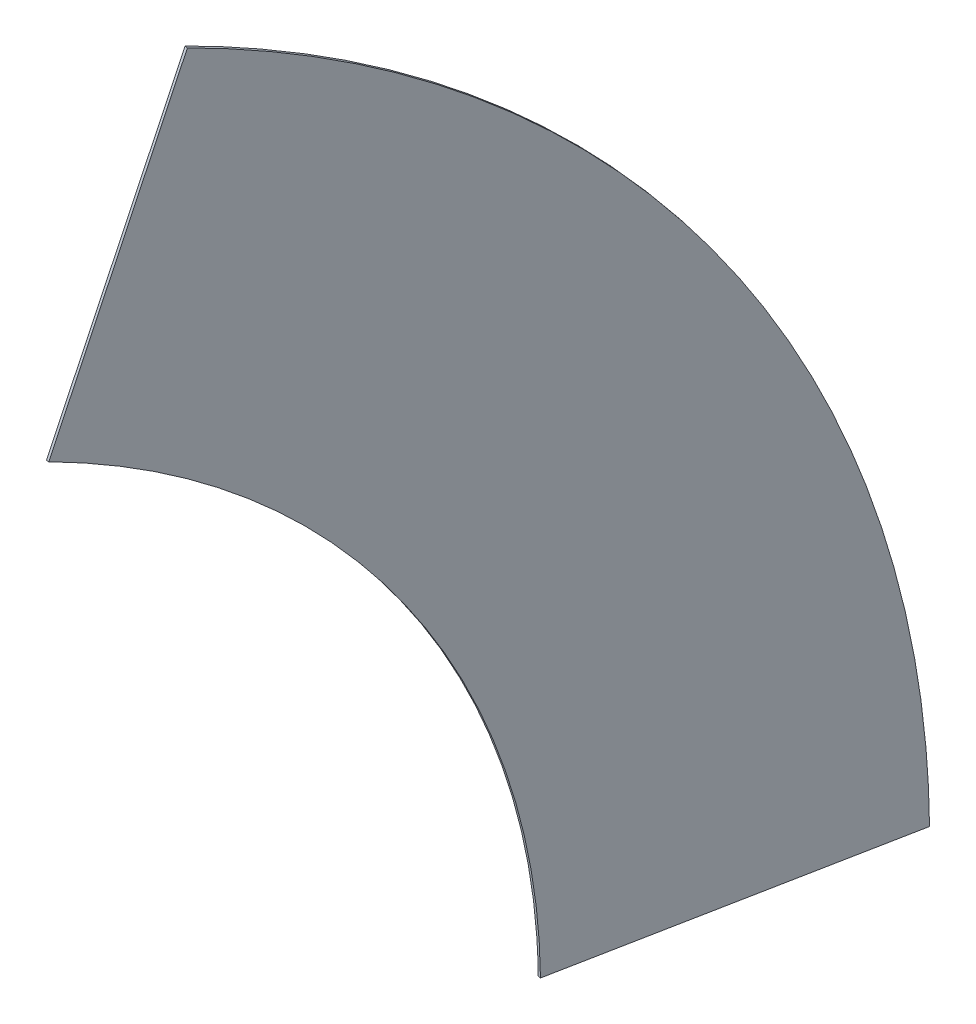
ISO-10303-21;
HEADER;
FILE_DESCRIPTION(('STEP AP214'),'2;1');
FILE_NAME('part.step','',(''),(''),'','','');
FILE_SCHEMA(('AUTOMOTIVE_DESIGN { 1 0 10303 214 1 1 1 1 }'));
ENDSEC;
DATA;
#1=APPLICATION_CONTEXT('core data for automotive mechanical design processes');
#2=APPLICATION_PROTOCOL_DEFINITION('international standard','automotive_design',2000,#1);
#3=PRODUCT_CONTEXT('',#1,'mechanical');
#4=PRODUCT('Part','Part','',(#3));
#5=PRODUCT_RELATED_PRODUCT_CATEGORY('part','',(#4));
#6=PRODUCT_DEFINITION_FORMATION('','',#4);
#7=PRODUCT_DEFINITION_CONTEXT('part definition',#1,'design');
#8=PRODUCT_DEFINITION('design','',#6,#7);
#9=PRODUCT_DEFINITION_SHAPE('','',#8);
#10=(LENGTH_UNIT() NAMED_UNIT(*) SI_UNIT(.MILLI.,.METRE.));
#11=(NAMED_UNIT(*) PLANE_ANGLE_UNIT() SI_UNIT($,.RADIAN.));
#12=(NAMED_UNIT(*) SI_UNIT($,.STERADIAN.) SOLID_ANGLE_UNIT());
#13=UNCERTAINTY_MEASURE_WITH_UNIT(LENGTH_MEASURE(1.E-05),#10,'distance_accuracy_value','');
#14=(GEOMETRIC_REPRESENTATION_CONTEXT(3) GLOBAL_UNCERTAINTY_ASSIGNED_CONTEXT((#13)) GLOBAL_UNIT_ASSIGNED_CONTEXT((#10,
#11,#12)) REPRESENTATION_CONTEXT('',''));
#15=CARTESIAN_POINT('',(0.,0.,0.));
#16=DIRECTION('',(0.,0.,1.));
#17=DIRECTION('',(1.,0.,0.));
#18=AXIS2_PLACEMENT_3D('',#15,#16,#17);
#19=CARTESIAN_POINT('',(528.314395580235,4.71909444700552,-0.984792222446074));
#20=DIRECTION('',(0.0103269269280288,-0.999944706836072,0.00198440186080273));
#21=DIRECTION('',(-0.190880415844772,-2.32941397990886E-05,0.981613297742197));
#22=AXIS2_PLACEMENT_3D('',#19,#20,#21);
#23=PLANE('',#22);
#24=DIRECTION('',(-0.981558975012276,-0.0105158322497583,-0.190870102019527));
#25=VECTOR('',#24,1.);
#26=CARTESIAN_POINT('',(528.314395580235,4.71909444700552,-0.984792222446072));
#27=LINE('',#26,#25);
#28=CARTESIAN_POINT('',(533.378626416939,4.77334956901912,-2.17898390997284E-05));
#29=VERTEX_POINT('',#28);
#30=CARTESIAN_POINT('',(525.587502052779,4.68988015053666,-1.51505322461909));
#31=VERTEX_POINT('',#30);
#32=EDGE_CURVE('E13',#29,#31,#27,.T.);
#33=ORIENTED_EDGE('',*,*,#32,.F.);
#34=DIRECTION('',(-0.190880415844772,-2.32941397990886E-05,0.981613297742197));
#35=VECTOR('',#34,1.);
#36=CARTESIAN_POINT('',(533.378626416939,4.77334956901912,-2.17898390997284E-05));
#37=LINE('',#36,#35);
#38=CARTESIAN_POINT('',(355.568218827284,4.75165043098133,914.400021789835));
#39=VERTEX_POINT('',#38);
#40=EDGE_CURVE('E375',#29,#39,#37,.T.);
#41=ORIENTED_EDGE('',*,*,#40,.T.);
#42=DIRECTION('',(-0.981558975012276,-0.0105158322497583,-0.190870102019527));
#43=VECTOR('',#42,1.);
#44=CARTESIAN_POINT('',(350.50398799058,4.69739530896773,913.415251357228));
#45=LINE('',#44,#43);
#46=CARTESIAN_POINT('',(347.777094463124,4.66818101249887,912.884990355055));
#47=VERTEX_POINT('',#46);
#48=EDGE_CURVE('E345',#39,#47,#45,.T.);
#49=ORIENTED_EDGE('',*,*,#48,.T.);
#50=DIRECTION('',(-0.190880415844772,-2.32941397990886E-05,0.981613297742197));
#51=VECTOR('',#50,1.);
#52=CARTESIAN_POINT('',(525.587502052779,4.68988015053667,-1.51505322461909));
#53=LINE('',#52,#51);
#54=EDGE_CURVE('E377',#31,#47,#53,.T.);
#55=ORIENTED_EDGE('',*,*,#54,.F.);
#56=EDGE_LOOP('',(#33,#41,#49,#55));
#57=FACE_BOUND('',#56,.T.);
#58=ADVANCED_FACE('F332',(#57),#23,.T.);
#59=CARTESIAN_POINT('',(347.777094463124,4.66818101249887,912.884990355055));
#60=CARTESIAN_POINT('',(346.787229060155,96.2196070562848,912.931471347845));
#61=CARTESIAN_POINT('',(344.504077378978,187.228931698317,919.658607862617));
#62=CARTESIAN_POINT('',(337.349981950212,368.208197090521,946.477994065531));
#63=CARTESIAN_POINT('',(332.518876649427,457.167595136207,966.42104758754));
#64=CARTESIAN_POINT('',(320.349219834697,632.016310584688,1019.37096484352));
#65=CARTESIAN_POINT('',(313.077945646682,716.937581121348,1052.08518533984));
#66=CARTESIAN_POINT('',(296.163053323035,881.768611472898,1129.98962794023));
#67=CARTESIAN_POINT('',(286.613221317811,960.76419398381,1174.74791606414));
#68=CARTESIAN_POINT('',(265.32982597315,1111.9081056179,1275.87168293359));
#69=CARTESIAN_POINT('',(253.713835041288,1183.22082189538,1331.6785771432));
#70=CARTESIAN_POINT('',(228.534671820406,1317.32029174413,1453.77557330167));
#71=CARTESIAN_POINT('',(215.111005758201,1379.36354602387,1519.38922003933));
#72=CARTESIAN_POINT('',(186.596412531771,1493.43346172051,1659.74234249575));
#73=CARTESIAN_POINT('',(171.662672156567,1544.83039264293,1733.70817183558));
#74=CARTESIAN_POINT('',(140.448320568531,1636.33056362603,1889.18839732688));
#75=CARTESIAN_POINT('',(124.33846113981,1675.93285916222,1969.85229308101));
#76=CARTESIAN_POINT('',(107.725918076385,1709.38736474306,2053.43997184362));
#77=CARTESIAN_POINT('',(355.568218827284,4.75165043098133,914.400021789835));
#78=CARTESIAN_POINT('',(354.578353424315,96.3030764747675,914.446502782625));
#79=CARTESIAN_POINT('',(352.295201743138,187.3124011168,921.173639297397));
#80=CARTESIAN_POINT('',(345.141106314372,368.291666509003,947.993025500311));
#81=CARTESIAN_POINT('',(340.310001013587,457.251064554689,967.93607902232));
#82=CARTESIAN_POINT('',(328.140344198858,632.099780003171,1020.8859962783));
#83=CARTESIAN_POINT('',(320.869070010842,717.02105053983,1053.60021677462));
#84=CARTESIAN_POINT('',(303.954177687195,881.85208089138,1131.50465937501));
#85=CARTESIAN_POINT('',(294.404345681971,960.847663402292,1176.26294749892));
#86=CARTESIAN_POINT('',(273.12095033731,1111.99157503639,1277.38671436837));
#87=CARTESIAN_POINT('',(261.504959405447,1183.30429131386,1333.19360857798));
#88=CARTESIAN_POINT('',(236.325796184566,1317.40376116262,1455.29060473645));
#89=CARTESIAN_POINT('',(222.902130122361,1379.44701544235,1520.90425147411));
#90=CARTESIAN_POINT('',(194.387536895931,1493.51693113899,1661.25737393053));
#91=CARTESIAN_POINT('',(179.453796520727,1544.91386206141,1735.22320327036));
#92=CARTESIAN_POINT('',(148.239444932691,1636.41403304451,1890.70342876166));
#93=CARTESIAN_POINT('',(132.12958550397,1676.0163285807,1971.36732451579));
#94=CARTESIAN_POINT('',(115.517042440545,1709.47083416154,2054.9550032784));
#95=B_SPLINE_SURFACE_WITH_KNOTS('',1,3,((#59,#60,#61,#62,#63,#64,#65,#66,#67,#68,#69,#70,#71,
#72,#73,#74,#75,#76),(#77,#78,#79,#80,#81,#82,#83,#84,#85,#86,#87,#88,#89,#90,#91,#92,#93,#94)),
.UNSPECIFIED.,.F.,.F.,.F.,(2,2),(4,2,2,2,2,2,2,2,4),(0.,1.),(0.,0.125,0.25,0.375,0.5,0.625,0.75,
0.875,1.),.UNSPECIFIED.);
#96=CARTESIAN_POINT('',(355.568218827284,4.75165043098133,914.400021789835));
#97=CARTESIAN_POINT('',(354.578353424315,96.3030764747675,914.446502782625));
#98=CARTESIAN_POINT('',(352.295201743138,187.3124011168,921.173639297397));
#99=CARTESIAN_POINT('',(345.141106314372,368.291666509003,947.993025500311));
#100=CARTESIAN_POINT('',(340.310001013587,457.251064554689,967.93607902232));
#101=CARTESIAN_POINT('',(328.140344198858,632.099780003171,1020.8859962783));
#102=CARTESIAN_POINT('',(320.869070010842,717.02105053983,1053.60021677462));
#103=CARTESIAN_POINT('',(303.954177687195,881.85208089138,1131.50465937501));
#104=CARTESIAN_POINT('',(294.404345681971,960.847663402292,1176.26294749892));
#105=CARTESIAN_POINT('',(273.12095033731,1111.99157503639,1277.38671436837));
#106=CARTESIAN_POINT('',(261.504959405447,1183.30429131386,1333.19360857798));
#107=CARTESIAN_POINT('',(236.325796184566,1317.40376116262,1455.29060473645));
#108=CARTESIAN_POINT('',(222.902130122361,1379.44701544235,1520.90425147411));
#109=CARTESIAN_POINT('',(194.387536895931,1493.51693113899,1661.25737393053));
#110=CARTESIAN_POINT('',(179.453796520727,1544.91386206141,1735.22320327036));
#111=CARTESIAN_POINT('',(148.239444932691,1636.41403304451,1890.70342876166));
#112=CARTESIAN_POINT('',(132.12958550397,1676.0163285807,1971.36732451579));
#113=CARTESIAN_POINT('',(115.517042440545,1709.47083416154,2054.9550032784));
#114=B_SPLINE_CURVE_WITH_KNOTS('',3,(#96,#97,#98,#99,#100,#101,#102,#103,#104,#105,#106,#107,
#108,#109,#110,#111,#112,#113),.UNSPECIFIED.,.F.,.F.,(4,2,2,2,2,2,2,2,4),(0.,0.125,0.25,0.375,
0.5,0.625,0.75,0.875,1.),.UNSPECIFIED.);
#115=CARTESIAN_POINT('',(115.517042440545,1709.47083416154,2054.9550032784));
#116=VERTEX_POINT('',#115);
#117=EDGE_CURVE('E390',#39,#116,#114,.T.);
#118=DIRECTION('',(-0.981558975012277,-0.0105158322497583,-0.190870102019527));
#119=VECTOR('',#118,1.);
#120=CARTESIAN_POINT('',(110.452811603842,1709.41657903953,2053.97023284579));
#121=LINE('',#120,#119);
#122=CARTESIAN_POINT('',(107.725918076385,1709.38736474306,2053.43997184362));
#123=VERTEX_POINT('',#122);
#124=EDGE_CURVE('E411',#116,#123,#121,.T.);
#125=CARTESIAN_POINT('',(107.725918076385,1709.38736474306,2053.43997184362));
#126=CARTESIAN_POINT('',(124.33846113981,1675.93285916222,1969.85229308101));
#127=CARTESIAN_POINT('',(140.448320568531,1636.33056362603,1889.18839732688));
#128=CARTESIAN_POINT('',(171.662672156567,1544.83039264293,1733.70817183558));
#129=CARTESIAN_POINT('',(186.596412531771,1493.43346172051,1659.74234249575));
#130=CARTESIAN_POINT('',(215.111005758201,1379.36354602387,1519.38922003933));
#131=CARTESIAN_POINT('',(228.534671820406,1317.32029174413,1453.77557330167));
#132=CARTESIAN_POINT('',(253.713835041288,1183.22082189538,1331.6785771432));
#133=CARTESIAN_POINT('',(265.32982597315,1111.9081056179,1275.87168293359));
#134=CARTESIAN_POINT('',(286.613221317811,960.76419398381,1174.74791606414));
#135=CARTESIAN_POINT('',(296.163053323035,881.768611472898,1129.98962794023));
#136=CARTESIAN_POINT('',(313.077945646682,716.937581121348,1052.08518533984));
#137=CARTESIAN_POINT('',(320.349219834697,632.016310584688,1019.37096484352));
#138=CARTESIAN_POINT('',(332.518876649427,457.167595136207,966.42104758754));
#139=CARTESIAN_POINT('',(337.349981950212,368.208197090521,946.477994065531));
#140=CARTESIAN_POINT('',(344.504077378978,187.228931698317,919.658607862617));
#141=CARTESIAN_POINT('',(346.787229060155,96.2196070562848,912.931471347845));
#142=CARTESIAN_POINT('',(347.777094463124,4.66818101249887,912.884990355055));
#143=B_SPLINE_CURVE_WITH_KNOTS('',3,(#125,#126,#127,#128,#129,#130,#131,#132,#133,#134,#135,
#136,#137,#138,#139,#140,#141,#142),.UNSPECIFIED.,.F.,.F.,(4,2,2,2,2,2,2,2,4),(0.,0.125,0.25,
0.375,0.5,0.625,0.75,0.875,1.),.UNSPECIFIED.);
#144=EDGE_CURVE('E420',#47,#123,#143,.F.);
#145=ORIENTED_EDGE('',*,*,#48,.F.);
#146=ORIENTED_EDGE('',*,*,#117,.T.);
#147=ORIENTED_EDGE('',*,*,#124,.T.);
#148=ORIENTED_EDGE('',*,*,#144,.F.);
#149=EDGE_LOOP('',(#145,#146,#147,#148));
#150=FACE_BOUND('',#149,.T.);
#151=ADVANCED_FACE('F474',(#150),#95,.T.);
#152=CARTESIAN_POINT('',(110.452811603842,1709.41657903953,2053.97023284579));
#153=DIRECTION('',(-0.181603406034153,0.363045139471929,0.913902855681392));
#154=DIRECTION('',(0.0596840136857799,0.931712210920251,-0.358259925937095));
#155=AXIS2_PLACEMENT_3D('',#152,#153,#154);
#156=PLANE('',#155);
#157=ORIENTED_EDGE('',*,*,#124,.F.);
#158=DIRECTION('',(0.0596840136857799,0.931712210920251,-0.358259925937095));
#159=VECTOR('',#158,1.);
#160=CARTESIAN_POINT('',(115.517042440546,1709.47083416154,2054.9550032784));
#161=LINE('',#160,#159);
#162=CARTESIAN_POINT('',(171.114358451662,2577.38662974905,1721.22593436376));
#163=VERTEX_POINT('',#162);
#164=EDGE_CURVE('E394',#116,#163,#161,.T.);
#165=ORIENTED_EDGE('',*,*,#164,.T.);
#166=DIRECTION('',(-0.981558975012277,-0.0105158322497583,-0.190870102019527));
#167=VECTOR('',#166,1.);
#168=CARTESIAN_POINT('',(166.050127614958,2577.33237462703,1720.24116393116));
#169=LINE('',#168,#167);
#170=CARTESIAN_POINT('',(163.323234087502,2577.30316033056,1719.71090292898));
#171=VERTEX_POINT('',#170);
#172=EDGE_CURVE('E354',#163,#171,#169,.T.);
#173=ORIENTED_EDGE('',*,*,#172,.T.);
#174=DIRECTION('',(0.0596840136857799,0.931712210920251,-0.358259925937095));
#175=VECTOR('',#174,1.);
#176=CARTESIAN_POINT('',(107.725918076385,1709.38736474306,2053.43997184362));
#177=LINE('',#176,#175);
#178=EDGE_CURVE('E417',#123,#171,#177,.T.);
#179=ORIENTED_EDGE('',*,*,#178,.F.);
#180=EDGE_LOOP('',(#157,#165,#173,#179));
#181=FACE_BOUND('',#180,.T.);
#182=ADVANCED_FACE('F450',(#181),#156,.T.);
#183=CARTESIAN_POINT('',(163.323234087502,2577.30316033056,1719.71090292898));
#184=CARTESIAN_POINT('',(175.845757752242,2552.14741129663,1656.69913875682));
#185=CARTESIAN_POINT('',(188.196675455583,2524.62744797438,1594.70012121385));
#186=CARTESIAN_POINT('',(212.553737212572,2464.86262249865,1472.73541617597));
#187=CARTESIAN_POINT('',(224.526598909781,2432.69930304276,1412.93639232301));
#188=CARTESIAN_POINT('',(248.059641120009,2363.81478132252,1295.71169092118));
#189=CARTESIAN_POINT('',(259.587626716004,2327.18765830503,1238.44639411214));
#190=CARTESIAN_POINT('',(282.165217011312,2249.56819118466,1126.61639629105));
#191=CARTESIAN_POINT('',(293.183965431584,2208.6817491034,1072.20454064044));
#192=CARTESIAN_POINT('',(314.680059314538,2122.76068205336,966.3935616709));
#193=CARTESIAN_POINT('',(325.128025947217,2077.84329324121,915.139061413505));
#194=CARTESIAN_POINT('',(345.422615989844,1984.10026763059,815.937820002254));
#195=CARTESIAN_POINT('',(355.241478979872,1935.4026628399,768.126784367135));
#196=CARTESIAN_POINT('',(374.221197247521,1834.3613576749,676.089429079268));
#197=CARTESIAN_POINT('',(383.356143116298,1782.15536538412,631.988762933418));
#198=CARTESIAN_POINT('',(400.915041032766,1674.37986615056,547.629061752911));
#199=CARTESIAN_POINT('',(409.315030149537,1618.95719013588,507.485167750146));
#200=CARTESIAN_POINT('',(425.355106226637,1505.04896232356,431.273960945597));
#201=CARTESIAN_POINT('',(432.973237577217,1446.71908443032,395.310979230381));
#202=CARTESIAN_POINT('',(447.404886874156,1327.31441994836,327.674008675465));
#203=CARTESIAN_POINT('',(454.198650945475,1266.40280582876,296.092615264988));
#204=CARTESIAN_POINT('',(466.941280176012,1142.16859657875,237.407594070907));
#205=CARTESIAN_POINT('',(472.872733239133,1079.01542070147,210.3841748406));
#206=CARTESIAN_POINT('',(483.855223168104,950.645027758025,160.978637043117));
#207=CARTESIAN_POINT('',(488.891237689601,885.603016774732,138.664118791617));
#208=CARTESIAN_POINT('',(498.052252541729,753.813325588778,98.8139904420802));
#209=CARTESIAN_POINT('',(502.164717824048,687.245525399179,81.3329321099785));
#210=CARTESIAN_POINT('',(509.453102185879,552.772538309851,51.2607330143245));
#211=CARTESIAN_POINT('',(512.619052767669,485.050672166987,38.7107558379202));
#212=CARTESIAN_POINT('',(517.994122392114,348.645034693274,18.5843505552219));
#213=CARTESIAN_POINT('',(520.195880470294,280.147187197116,11.035533252467));
#214=CARTESIAN_POINT('',(523.627608676053,142.570834978681,0.967357260680757));
#215=CARTESIAN_POINT('',(524.852861169255,73.6811246662269,-1.53814223305027));
#216=CARTESIAN_POINT('',(525.587502052779,4.68988015053666,-1.51505322461909));
#217=CARTESIAN_POINT('',(171.114358451662,2577.38662974905,1721.22593436376));
#218=CARTESIAN_POINT('',(183.636882116402,2552.23088071511,1658.2141701916));
#219=CARTESIAN_POINT('',(195.987799819743,2524.71091739287,1596.21515264863));
#220=CARTESIAN_POINT('',(220.344861576732,2464.94609191713,1474.25044761075));
#221=CARTESIAN_POINT('',(232.317723273941,2432.78277246124,1414.45142375779));
#222=CARTESIAN_POINT('',(255.850765484169,2363.898250741,1297.22672235596));
#223=CARTESIAN_POINT('',(267.378751080165,2327.27112772351,1239.96142554692));
#224=CARTESIAN_POINT('',(289.956341375472,2249.65166060315,1128.13142772583));
#225=CARTESIAN_POINT('',(300.975089795744,2208.76521852188,1073.71957207522));
#226=CARTESIAN_POINT('',(322.471183678698,2122.84415147185,967.90859310568));
#227=CARTESIAN_POINT('',(332.919150311377,2077.92676265969,916.654092848285));
#228=CARTESIAN_POINT('',(353.213740354004,1984.18373704907,817.452851437034));
#229=CARTESIAN_POINT('',(363.032603344032,1935.48613225838,769.641815801915));
#230=CARTESIAN_POINT('',(382.01232161168,1834.44482709338,677.604460514048));
#231=CARTESIAN_POINT('',(391.147267480458,1782.2388348026,633.503794368198));
#232=CARTESIAN_POINT('',(408.706165396926,1674.46333556904,549.144093187691));
#233=CARTESIAN_POINT('',(417.106154513697,1619.04065955436,509.000199184926));
#234=CARTESIAN_POINT('',(433.146230590797,1505.13243174204,432.788992380377));
#235=CARTESIAN_POINT('',(440.764361941377,1446.8025538488,396.826010665161));
#236=CARTESIAN_POINT('',(455.196011238315,1327.39788936684,329.189040110245));
#237=CARTESIAN_POINT('',(461.989775309635,1266.48627524725,297.607646699768));
#238=CARTESIAN_POINT('',(474.732404540172,1142.25206599723,238.922625505687));
#239=CARTESIAN_POINT('',(480.663857603293,1079.09889011996,211.899206275379));
#240=CARTESIAN_POINT('',(491.646347532264,950.728497176508,162.493668477897));
#241=CARTESIAN_POINT('',(496.682362053761,885.686486193215,140.179150226397));
#242=CARTESIAN_POINT('',(505.843376905889,753.896795007261,100.32902187686));
#243=CARTESIAN_POINT('',(509.955842188208,687.328994817662,82.8479635447585));
#244=CARTESIAN_POINT('',(517.244226550039,552.856007728334,52.7757644491045));
#245=CARTESIAN_POINT('',(520.410177131829,485.134141585469,40.2257872727001));
#246=CARTESIAN_POINT('',(525.785246756274,348.728504111757,20.0993819900019));
#247=CARTESIAN_POINT('',(527.987004834454,280.230656615599,12.550564687247));
#248=CARTESIAN_POINT('',(531.418733040213,142.654304397163,2.4823886954608));
#249=CARTESIAN_POINT('',(532.643985533415,73.7645940847095,-0.0231107982702206));
#250=CARTESIAN_POINT('',(533.378626416939,4.77334956901912,-2.17898390997284E-05));
#251=B_SPLINE_SURFACE_WITH_KNOTS('',1,3,((#183,#184,#185,#186,#187,#188,#189,#190,#191,#192,
#193,#194,#195,#196,#197,#198,#199,#200,#201,#202,#203,#204,#205,#206,#207,#208,#209,#210,#211,
#212,#213,#214,#215,#216),(#217,#218,#219,#220,#221,#222,#223,#224,#225,#226,#227,#228,#229,
#230,#231,#232,#233,#234,#235,#236,#237,#238,#239,#240,#241,#242,#243,#244,#245,#246,#247,#248,
#249,#250)),.UNSPECIFIED.,.F.,.F.,.F.,(2,2),(4,2,2,2,2,2,2,2,2,2,2,2,2,2,2,2,4),(0.,1.),(0.,
0.0625,0.125,0.1875,0.25,0.3125,0.375,0.4375,0.5,0.5625,0.625,0.6875,0.75,0.8125,0.875,0.9375,
1.),.UNSPECIFIED.);
#252=CARTESIAN_POINT('',(171.114358451662,2577.38662974905,1721.22593436376));
#253=CARTESIAN_POINT('',(183.636882116402,2552.23088071511,1658.2141701916));
#254=CARTESIAN_POINT('',(195.987799819743,2524.71091739287,1596.21515264863));
#255=CARTESIAN_POINT('',(220.344861576732,2464.94609191713,1474.25044761075));
#256=CARTESIAN_POINT('',(232.317723273941,2432.78277246124,1414.45142375779));
#257=CARTESIAN_POINT('',(255.850765484169,2363.898250741,1297.22672235596));
#258=CARTESIAN_POINT('',(267.378751080165,2327.27112772351,1239.96142554692));
#259=CARTESIAN_POINT('',(289.956341375472,2249.65166060315,1128.13142772583));
#260=CARTESIAN_POINT('',(300.975089795744,2208.76521852188,1073.71957207522));
#261=CARTESIAN_POINT('',(322.471183678698,2122.84415147185,967.90859310568));
#262=CARTESIAN_POINT('',(332.919150311377,2077.92676265969,916.654092848285));
#263=CARTESIAN_POINT('',(353.213740354004,1984.18373704907,817.452851437034));
#264=CARTESIAN_POINT('',(363.032603344032,1935.48613225838,769.641815801915));
#265=CARTESIAN_POINT('',(382.01232161168,1834.44482709338,677.604460514048));
#266=CARTESIAN_POINT('',(391.147267480458,1782.2388348026,633.503794368198));
#267=CARTESIAN_POINT('',(408.706165396926,1674.46333556904,549.144093187691));
#268=CARTESIAN_POINT('',(417.106154513697,1619.04065955436,509.000199184926));
#269=CARTESIAN_POINT('',(433.146230590797,1505.13243174204,432.788992380377));
#270=CARTESIAN_POINT('',(440.764361941377,1446.8025538488,396.826010665161));
#271=CARTESIAN_POINT('',(455.196011238315,1327.39788936684,329.189040110245));
#272=CARTESIAN_POINT('',(461.989775309635,1266.48627524725,297.607646699768));
#273=CARTESIAN_POINT('',(474.732404540172,1142.25206599723,238.922625505687));
#274=CARTESIAN_POINT('',(480.663857603293,1079.09889011996,211.899206275379));
#275=CARTESIAN_POINT('',(491.646347532264,950.728497176508,162.493668477897));
#276=CARTESIAN_POINT('',(496.682362053761,885.686486193215,140.179150226397));
#277=CARTESIAN_POINT('',(505.843376905889,753.896795007261,100.32902187686));
#278=CARTESIAN_POINT('',(509.955842188208,687.328994817662,82.8479635447585));
#279=CARTESIAN_POINT('',(517.244226550039,552.856007728334,52.7757644491045));
#280=CARTESIAN_POINT('',(520.410177131829,485.134141585469,40.2257872727001));
#281=CARTESIAN_POINT('',(525.785246756274,348.728504111757,20.0993819900019));
#282=CARTESIAN_POINT('',(527.987004834454,280.230656615599,12.550564687247));
#283=CARTESIAN_POINT('',(531.418733040213,142.654304397163,2.4823886954608));
#284=CARTESIAN_POINT('',(532.643985533415,73.7645940847095,-0.0231107982702206));
#285=CARTESIAN_POINT('',(533.378626416939,4.77334956901912,-2.17898390997284E-05));
#286=B_SPLINE_CURVE_WITH_KNOTS('',3,(#252,#253,#254,#255,#256,#257,#258,#259,#260,#261,#262,
#263,#264,#265,#266,#267,#268,#269,#270,#271,#272,#273,#274,#275,#276,#277,#278,#279,#280,#281,
#282,#283,#284,#285),.UNSPECIFIED.,.F.,.F.,(4,2,2,2,2,2,2,2,2,2,2,2,2,2,2,2,4),(0.,0.0625,0.125,
0.1875,0.25,0.3125,0.375,0.4375,0.5,0.5625,0.625,0.6875,0.75,0.8125,0.875,0.9375,1.),.UNSPECIFIED.);
#287=EDGE_CURVE('E387',#163,#29,#286,.T.);
#288=CARTESIAN_POINT('',(525.587502052779,4.68988015053666,-1.51505322461909));
#289=CARTESIAN_POINT('',(524.852861169255,73.6811246662269,-1.53814223305027));
#290=CARTESIAN_POINT('',(523.627608676053,142.570834978681,0.967357260680757));
#291=CARTESIAN_POINT('',(520.195880470294,280.147187197116,11.035533252467));
#292=CARTESIAN_POINT('',(517.994122392114,348.645034693274,18.5843505552219));
#293=CARTESIAN_POINT('',(512.619052767669,485.050672166987,38.7107558379202));
#294=CARTESIAN_POINT('',(509.453102185879,552.772538309851,51.2607330143245));
#295=CARTESIAN_POINT('',(502.164717824048,687.245525399179,81.3329321099785));
#296=CARTESIAN_POINT('',(498.052252541729,753.813325588778,98.8139904420802));
#297=CARTESIAN_POINT('',(488.891237689601,885.603016774732,138.664118791617));
#298=CARTESIAN_POINT('',(483.855223168104,950.645027758025,160.978637043117));
#299=CARTESIAN_POINT('',(472.872733239133,1079.01542070147,210.3841748406));
#300=CARTESIAN_POINT('',(466.941280176012,1142.16859657875,237.407594070907));
#301=CARTESIAN_POINT('',(454.198650945475,1266.40280582876,296.092615264988));
#302=CARTESIAN_POINT('',(447.404886874156,1327.31441994836,327.674008675465));
#303=CARTESIAN_POINT('',(432.973237577217,1446.71908443032,395.310979230381));
#304=CARTESIAN_POINT('',(425.355106226637,1505.04896232356,431.273960945597));
#305=CARTESIAN_POINT('',(409.315030149537,1618.95719013588,507.485167750146));
#306=CARTESIAN_POINT('',(400.915041032766,1674.37986615056,547.629061752911));
#307=CARTESIAN_POINT('',(383.356143116298,1782.15536538412,631.988762933418));
#308=CARTESIAN_POINT('',(374.221197247521,1834.3613576749,676.089429079268));
#309=CARTESIAN_POINT('',(355.241478979872,1935.4026628399,768.126784367135));
#310=CARTESIAN_POINT('',(345.422615989844,1984.10026763059,815.937820002254));
#311=CARTESIAN_POINT('',(325.128025947217,2077.84329324121,915.139061413505));
#312=CARTESIAN_POINT('',(314.680059314538,2122.76068205336,966.3935616709));
#313=CARTESIAN_POINT('',(293.183965431584,2208.6817491034,1072.20454064044));
#314=CARTESIAN_POINT('',(282.165217011312,2249.56819118466,1126.61639629105));
#315=CARTESIAN_POINT('',(259.587626716004,2327.18765830503,1238.44639411214));
#316=CARTESIAN_POINT('',(248.059641120009,2363.81478132252,1295.71169092118));
#317=CARTESIAN_POINT('',(224.526598909781,2432.69930304276,1412.93639232301));
#318=CARTESIAN_POINT('',(212.553737212572,2464.86262249865,1472.73541617597));
#319=CARTESIAN_POINT('',(188.196675455583,2524.62744797438,1594.70012121385));
#320=CARTESIAN_POINT('',(175.845757752242,2552.14741129663,1656.69913875682));
#321=CARTESIAN_POINT('',(163.323234087502,2577.30316033056,1719.71090292898));
#322=B_SPLINE_CURVE_WITH_KNOTS('',3,(#288,#289,#290,#291,#292,#293,#294,#295,#296,#297,#298,
#299,#300,#301,#302,#303,#304,#305,#306,#307,#308,#309,#310,#311,#312,#313,#314,#315,#316,#317,
#318,#319,#320,#321),.UNSPECIFIED.,.F.,.F.,(4,2,2,2,2,2,2,2,2,2,2,2,2,2,2,2,4),(0.,0.0625,0.125,
0.1875,0.25,0.3125,0.375,0.4375,0.5,0.5625,0.625,0.6875,0.75,0.8125,0.875,0.9375,1.),.UNSPECIFIED.);
#323=EDGE_CURVE('E416',#171,#31,#322,.F.);
#324=ORIENTED_EDGE('',*,*,#287,.T.);
#325=ORIENTED_EDGE('',*,*,#32,.T.);
#326=ORIENTED_EDGE('',*,*,#323,.F.);
#327=ORIENTED_EDGE('',*,*,#172,.F.);
#328=EDGE_LOOP('',(#324,#325,#326,#327));
#329=FACE_BOUND('',#328,.T.);
#330=ADVANCED_FACE('F334',(#329),#251,.T.);
#331=CARTESIAN_POINT('',(436.682298257951,4.67903058151744,455.684968565218));
#332=DIRECTION('',(-0.981558975012276,-0.0105158322497583,-0.190870102019527));
#333=DIRECTION('',(-0.19088065636316,0.,0.981613251248357));
#334=AXIS2_PLACEMENT_3D('',#331,#332,#333);
#335=PLANE('',#334);
#336=ORIENTED_EDGE('',*,*,#178,.T.);
#337=ORIENTED_EDGE('',*,*,#323,.T.);
#338=ORIENTED_EDGE('',*,*,#54,.T.);
#339=ORIENTED_EDGE('',*,*,#144,.T.);
#340=EDGE_LOOP('',(#336,#337,#338,#339));
#341=FACE_BOUND('',#340,.T.);
#342=ADVANCED_FACE('F448',(#341),#335,.T.);
#343=CARTESIAN_POINT('',(444.473422622111,4.7624999999999,457.199999999998));
#344=DIRECTION('',(-0.981558975012276,-0.0105158322497583,-0.190870102019527));
#345=DIRECTION('',(-0.19088065636316,0.,0.981613251248357));
#346=AXIS2_PLACEMENT_3D('',#343,#344,#345);
#347=PLANE('',#346);
#348=ORIENTED_EDGE('',*,*,#164,.F.);
#349=ORIENTED_EDGE('',*,*,#117,.F.);
#350=ORIENTED_EDGE('',*,*,#40,.F.);
#351=ORIENTED_EDGE('',*,*,#287,.F.);
#352=EDGE_LOOP('',(#348,#349,#350,#351));
#353=FACE_BOUND('',#352,.T.);
#354=ADVANCED_FACE('F386',(#353),#347,.F.);
#355=CLOSED_SHELL('',(#58,#151,#182,#330,#342,#354));
#356=MANIFOLD_SOLID_BREP('B2',#355);
#357=ADVANCED_BREP_SHAPE_REPRESENTATION('',(#18,#356),#14);
#358=SHAPE_DEFINITION_REPRESENTATION(#9,#357);
ENDSEC;
END-ISO-10303-21;
